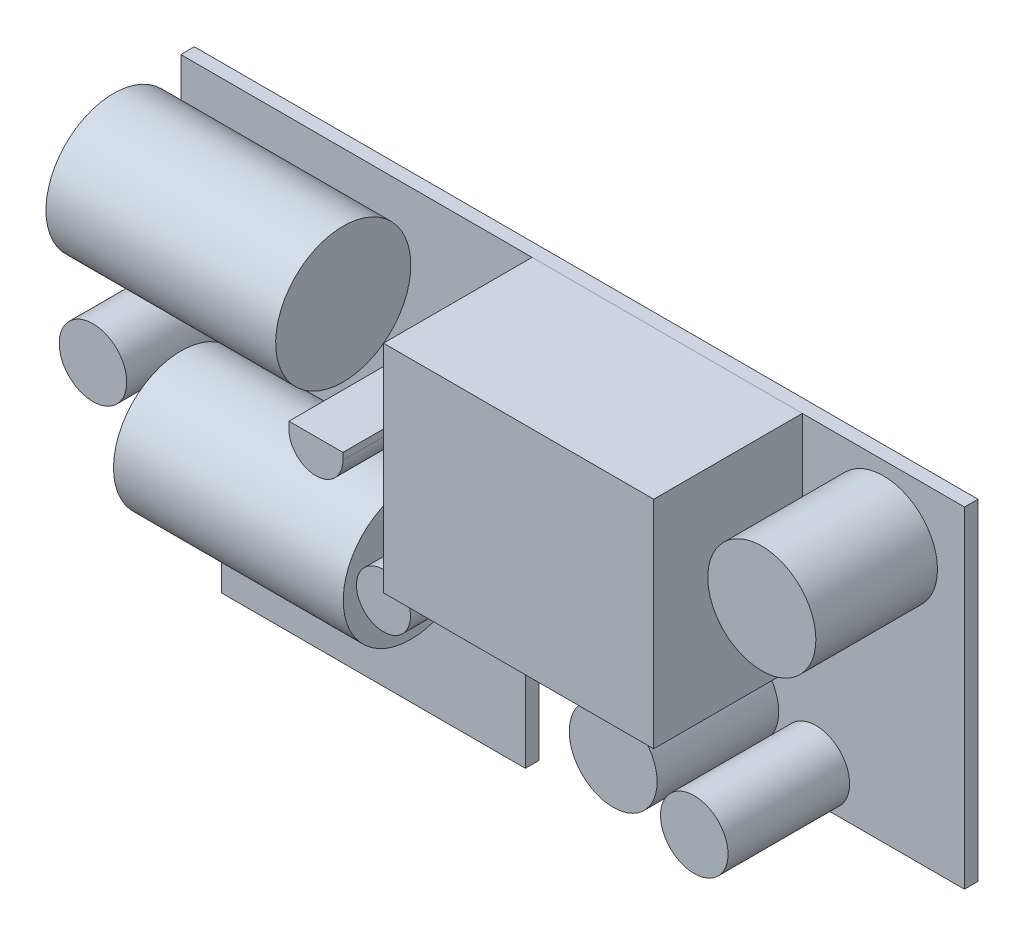
ISO-10303-21;
HEADER;
FILE_DESCRIPTION(('STEP AP214'),'2;1');
FILE_NAME('part.step','',(''),(''),'','','');
FILE_SCHEMA(('AUTOMOTIVE_DESIGN { 1 0 10303 214 1 1 1 1 }'));
ENDSEC;
DATA;
#1=APPLICATION_CONTEXT('core data for automotive mechanical design processes');
#2=APPLICATION_PROTOCOL_DEFINITION('international standard','automotive_design',2000,#1);
#3=PRODUCT_CONTEXT('',#1,'mechanical');
#4=PRODUCT('Part','Part','',(#3));
#5=PRODUCT_RELATED_PRODUCT_CATEGORY('part','',(#4));
#6=PRODUCT_DEFINITION_FORMATION('','',#4);
#7=PRODUCT_DEFINITION_CONTEXT('part definition',#1,'design');
#8=PRODUCT_DEFINITION('design','',#6,#7);
#9=PRODUCT_DEFINITION_SHAPE('','',#8);
#10=(LENGTH_UNIT() NAMED_UNIT(*) SI_UNIT(.MILLI.,.METRE.));
#11=(NAMED_UNIT(*) PLANE_ANGLE_UNIT() SI_UNIT($,.RADIAN.));
#12=(NAMED_UNIT(*) SI_UNIT($,.STERADIAN.) SOLID_ANGLE_UNIT());
#13=UNCERTAINTY_MEASURE_WITH_UNIT(LENGTH_MEASURE(1.E-05),#10,'distance_accuracy_value','');
#14=(GEOMETRIC_REPRESENTATION_CONTEXT(3) GLOBAL_UNCERTAINTY_ASSIGNED_CONTEXT((#13)) GLOBAL_UNIT_ASSIGNED_CONTEXT((#10,
#11,#12)) REPRESENTATION_CONTEXT('',''));
#15=CARTESIAN_POINT('',(0.,0.,0.));
#16=DIRECTION('',(0.,0.,1.));
#17=DIRECTION('',(1.,0.,0.));
#18=AXIS2_PLACEMENT_3D('',#15,#16,#17);
#19=CARTESIAN_POINT('',(-7.00000000000001,-2.5,5.97865494088978));
#20=DIRECTION('',(-1.,0.,0.));
#21=DIRECTION('',(0.,-1.,0.));
#22=AXIS2_PLACEMENT_3D('',#19,#20,#21);
#23=CYLINDRICAL_SURFACE('',#22,5.);
#24=CARTESIAN_POINT('',(-7.00000000000001,-2.5,5.97865494088978));
#25=DIRECTION('',(-1.,0.,0.));
#26=DIRECTION('',(0.,-1.,0.));
#27=AXIS2_PLACEMENT_3D('',#24,#25,#26);
#28=CIRCLE('',#27,5.);
#29=CARTESIAN_POINT('',(-7.00000000000001,-7.50000000000001,5.97865494088978));
#30=VERTEX_POINT('',#29);
#31=EDGE_CURVE('E11',#30,#30,#28,.T.);
#32=ORIENTED_EDGE('',*,*,#31,.T.);
#33=EDGE_LOOP('',(#32));
#34=FACE_BOUND('',#33,.T.);
#35=CARTESIAN_POINT('',(-24.,-2.5,5.97865494088978));
#36=DIRECTION('',(-1.,0.,0.));
#37=DIRECTION('',(0.,-1.,0.));
#38=AXIS2_PLACEMENT_3D('',#35,#36,#37);
#39=CIRCLE('',#38,5.);
#40=CARTESIAN_POINT('',(-24.,-7.50000000000001,5.97865494088978));
#41=VERTEX_POINT('',#40);
#42=EDGE_CURVE('E47',#41,#41,#39,.T.);
#43=ORIENTED_EDGE('',*,*,#42,.F.);
#44=EDGE_LOOP('',(#43));
#45=FACE_BOUND('',#44,.T.);
#46=ADVANCED_FACE('F44',(#34,#45),#23,.T.);
#47=CARTESIAN_POINT('',(-7.00000000000001,-2.5,5.97865494088978));
#48=DIRECTION('',(-1.,0.,0.));
#49=DIRECTION('',(0.,-1.,0.));
#50=AXIS2_PLACEMENT_3D('',#47,#48,#49);
#51=PLANE('',#50);
#52=ORIENTED_EDGE('',*,*,#31,.F.);
#53=EDGE_LOOP('',(#52));
#54=FACE_BOUND('',#53,.T.);
#55=ADVANCED_FACE('F59',(#54),#51,.F.);
#56=CARTESIAN_POINT('',(-24.,-2.5,5.97865494088978));
#57=DIRECTION('',(-1.,0.,0.));
#58=DIRECTION('',(0.,-1.,0.));
#59=AXIS2_PLACEMENT_3D('',#56,#57,#58);
#60=PLANE('',#59);
#61=ORIENTED_EDGE('',*,*,#42,.T.);
#62=EDGE_LOOP('',(#61));
#63=FACE_BOUND('',#62,.T.);
#64=ADVANCED_FACE('F56',(#63),#60,.T.);
#65=CLOSED_SHELL('',(#46,#55,#64));
#66=MANIFOLD_SOLID_BREP('B2',#65);
#67=CARTESIAN_POINT('',(-12.,11.5,5.97865494088978));
#68=DIRECTION('',(-1.,0.,0.));
#69=DIRECTION('',(0.,-1.,0.));
#70=AXIS2_PLACEMENT_3D('',#67,#68,#69);
#71=CYLINDRICAL_SURFACE('',#70,5.);
#72=CARTESIAN_POINT('',(-12.,11.5,5.97865494088978));
#73=DIRECTION('',(-1.,0.,0.));
#74=DIRECTION('',(0.,-1.,0.));
#75=AXIS2_PLACEMENT_3D('',#72,#73,#74);
#76=CIRCLE('',#75,5.);
#77=CARTESIAN_POINT('',(-12.,6.5,5.97865494088978));
#78=VERTEX_POINT('',#77);
#79=EDGE_CURVE('E43',#78,#78,#76,.T.);
#80=ORIENTED_EDGE('',*,*,#79,.T.);
#81=EDGE_LOOP('',(#80));
#82=FACE_BOUND('',#81,.T.);
#83=CARTESIAN_POINT('',(-29.,11.5,5.97865494088978));
#84=DIRECTION('',(-1.,0.,0.));
#85=DIRECTION('',(0.,-1.,0.));
#86=AXIS2_PLACEMENT_3D('',#83,#84,#85);
#87=CIRCLE('',#86,5.);
#88=CARTESIAN_POINT('',(-29.,6.5,5.97865494088978));
#89=VERTEX_POINT('',#88);
#90=EDGE_CURVE('E98',#89,#89,#87,.T.);
#91=ORIENTED_EDGE('',*,*,#90,.F.);
#92=EDGE_LOOP('',(#91));
#93=FACE_BOUND('',#92,.T.);
#94=ADVANCED_FACE('F95',(#82,#93),#71,.T.);
#95=CARTESIAN_POINT('',(-12.,11.5,5.97865494088978));
#96=DIRECTION('',(-1.,0.,0.));
#97=DIRECTION('',(0.,-1.,0.));
#98=AXIS2_PLACEMENT_3D('',#95,#96,#97);
#99=PLANE('',#98);
#100=ORIENTED_EDGE('',*,*,#79,.F.);
#101=EDGE_LOOP('',(#100));
#102=FACE_BOUND('',#101,.T.);
#103=ADVANCED_FACE('F110',(#102),#99,.F.);
#104=CARTESIAN_POINT('',(-29.,11.5,5.97865494088978));
#105=DIRECTION('',(-1.,0.,0.));
#106=DIRECTION('',(0.,-1.,0.));
#107=AXIS2_PLACEMENT_3D('',#104,#105,#106);
#108=PLANE('',#107);
#109=ORIENTED_EDGE('',*,*,#90,.T.);
#110=EDGE_LOOP('',(#109));
#111=FACE_BOUND('',#110,.T.);
#112=ADVANCED_FACE('F107',(#111),#108,.T.);
#113=CLOSED_SHELL('',(#94,#103,#112));
#114=MANIFOLD_SOLID_BREP('B6',#113);
#115=CARTESIAN_POINT('',(-12.,6.,10.));
#116=DIRECTION('',(1.,0.,0.));
#117=DIRECTION('',(0.,0.,-1.));
#118=AXIS2_PLACEMENT_3D('',#115,#116,#117);
#119=PLANE('',#118);
#120=DIRECTION('',(0.,-1.,0.));
#121=VECTOR('',#120,1.);
#122=CARTESIAN_POINT('',(-12.,6.,1.));
#123=LINE('',#122,#121);
#124=CARTESIAN_POINT('',(-12.,6.,1.));
#125=VERTEX_POINT('',#124);
#126=CARTESIAN_POINT('',(-12.,5.5,1.));
#127=VERTEX_POINT('',#126);
#128=EDGE_CURVE('E207',#125,#127,#123,.T.);
#129=ORIENTED_EDGE('',*,*,#128,.T.);
#130=DIRECTION('',(0.,0.,-1.));
#131=VECTOR('',#130,1.);
#132=CARTESIAN_POINT('',(-12.,5.5,10.));
#133=LINE('',#132,#131);
#134=CARTESIAN_POINT('',(-12.,5.5,10.));
#135=VERTEX_POINT('',#134);
#136=EDGE_CURVE('E93',#135,#127,#133,.T.);
#137=ORIENTED_EDGE('',*,*,#136,.F.);
#138=DIRECTION('',(0.,-1.,0.));
#139=VECTOR('',#138,1.);
#140=CARTESIAN_POINT('',(-12.,6.,10.));
#141=LINE('',#140,#139);
#142=CARTESIAN_POINT('',(-12.,6.,10.));
#143=VERTEX_POINT('',#142);
#144=EDGE_CURVE('E195',#143,#135,#141,.T.);
#145=ORIENTED_EDGE('',*,*,#144,.F.);
#146=DIRECTION('',(0.,0.,-1.));
#147=VECTOR('',#146,1.);
#148=CARTESIAN_POINT('',(-12.,6.,10.));
#149=LINE('',#148,#147);
#150=EDGE_CURVE('E203',#143,#125,#149,.T.);
#151=ORIENTED_EDGE('',*,*,#150,.T.);
#152=EDGE_LOOP('',(#129,#137,#145,#151));
#153=FACE_BOUND('',#152,.T.);
#154=ADVANCED_FACE('F144',(#153),#119,.F.);
#155=CARTESIAN_POINT('',(-10.,5.5,10.));
#156=DIRECTION('',(0.,0.,-1.));
#157=DIRECTION('',(-1.,0.,0.));
#158=AXIS2_PLACEMENT_3D('',#155,#156,#157);
#159=CYLINDRICAL_SURFACE('',#158,2.);
#160=CARTESIAN_POINT('',(-10.,5.5,1.));
#161=DIRECTION('',(0.,0.,1.));
#162=DIRECTION('',(1.,0.,0.));
#163=AXIS2_PLACEMENT_3D('',#160,#161,#162);
#164=CIRCLE('',#163,2.);
#165=CARTESIAN_POINT('',(-8.00000000000001,5.5,1.));
#166=VERTEX_POINT('',#165);
#167=EDGE_CURVE('E199',#127,#166,#164,.T.);
#168=ORIENTED_EDGE('',*,*,#167,.T.);
#169=DIRECTION('',(0.,0.,-1.));
#170=VECTOR('',#169,1.);
#171=CARTESIAN_POINT('',(-8.00000000000001,5.5,10.));
#172=LINE('',#171,#170);
#173=CARTESIAN_POINT('',(-8.00000000000001,5.5,10.));
#174=VERTEX_POINT('',#173);
#175=EDGE_CURVE('E152',#174,#166,#172,.T.);
#176=ORIENTED_EDGE('',*,*,#175,.F.);
#177=CARTESIAN_POINT('',(-10.,5.5,10.));
#178=DIRECTION('',(0.,0.,1.));
#179=DIRECTION('',(1.,0.,0.));
#180=AXIS2_PLACEMENT_3D('',#177,#178,#179);
#181=CIRCLE('',#180,2.);
#182=EDGE_CURVE('E190',#135,#174,#181,.T.);
#183=ORIENTED_EDGE('',*,*,#182,.F.);
#184=ORIENTED_EDGE('',*,*,#136,.T.);
#185=EDGE_LOOP('',(#168,#176,#183,#184));
#186=FACE_BOUND('',#185,.T.);
#187=ADVANCED_FACE('F198',(#186),#159,.T.);
#188=CARTESIAN_POINT('',(-8.00000000000001,6.,10.));
#189=DIRECTION('',(-1.,0.,0.));
#190=DIRECTION('',(0.,0.,1.));
#191=AXIS2_PLACEMENT_3D('',#188,#189,#190);
#192=PLANE('',#191);
#193=DIRECTION('',(0.,1.,0.));
#194=VECTOR('',#193,1.);
#195=CARTESIAN_POINT('',(-8.00000000000001,6.,1.));
#196=LINE('',#195,#194);
#197=CARTESIAN_POINT('',(-8.00000000000001,6.,1.));
#198=VERTEX_POINT('',#197);
#199=EDGE_CURVE('E177',#166,#198,#196,.T.);
#200=ORIENTED_EDGE('',*,*,#199,.T.);
#201=DIRECTION('',(0.,0.,-1.));
#202=VECTOR('',#201,1.);
#203=CARTESIAN_POINT('',(-8.00000000000001,6.,10.));
#204=LINE('',#203,#202);
#205=CARTESIAN_POINT('',(-8.00000000000001,6.,10.));
#206=VERTEX_POINT('',#205);
#207=EDGE_CURVE('E200',#206,#198,#204,.T.);
#208=ORIENTED_EDGE('',*,*,#207,.F.);
#209=DIRECTION('',(0.,1.,0.));
#210=VECTOR('',#209,1.);
#211=CARTESIAN_POINT('',(-8.00000000000001,6.,10.));
#212=LINE('',#211,#210);
#213=EDGE_CURVE('E193',#174,#206,#212,.T.);
#214=ORIENTED_EDGE('',*,*,#213,.F.);
#215=ORIENTED_EDGE('',*,*,#175,.T.);
#216=EDGE_LOOP('',(#200,#208,#214,#215));
#217=FACE_BOUND('',#216,.T.);
#218=ADVANCED_FACE('F201',(#217),#192,.F.);
#219=CARTESIAN_POINT('',(-12.,6.,10.));
#220=DIRECTION('',(0.,-1.,0.));
#221=DIRECTION('',(0.,0.,-1.));
#222=AXIS2_PLACEMENT_3D('',#219,#220,#221);
#223=PLANE('',#222);
#224=DIRECTION('',(-1.,0.,0.));
#225=VECTOR('',#224,1.);
#226=CARTESIAN_POINT('',(-12.,6.,1.));
#227=LINE('',#226,#225);
#228=EDGE_CURVE('E183',#198,#125,#227,.T.);
#229=ORIENTED_EDGE('',*,*,#228,.T.);
#230=ORIENTED_EDGE('',*,*,#150,.F.);
#231=DIRECTION('',(-1.,0.,0.));
#232=VECTOR('',#231,1.);
#233=CARTESIAN_POINT('',(-12.,6.,10.));
#234=LINE('',#233,#232);
#235=EDGE_CURVE('E160',#206,#143,#234,.T.);
#236=ORIENTED_EDGE('',*,*,#235,.F.);
#237=ORIENTED_EDGE('',*,*,#207,.T.);
#238=EDGE_LOOP('',(#229,#230,#236,#237));
#239=FACE_BOUND('',#238,.T.);
#240=ADVANCED_FACE('F214',(#239),#223,.F.);
#241=CARTESIAN_POINT('',(-10.,5.5,10.));
#242=DIRECTION('',(0.,0.,1.));
#243=DIRECTION('',(1.,0.,0.));
#244=AXIS2_PLACEMENT_3D('',#241,#242,#243);
#245=PLANE('',#244);
#246=ORIENTED_EDGE('',*,*,#144,.T.);
#247=ORIENTED_EDGE('',*,*,#182,.T.);
#248=ORIENTED_EDGE('',*,*,#213,.T.);
#249=ORIENTED_EDGE('',*,*,#235,.T.);
#250=EDGE_LOOP('',(#246,#247,#248,#249));
#251=FACE_BOUND('',#250,.T.);
#252=ADVANCED_FACE('F191',(#251),#245,.T.);
#253=CARTESIAN_POINT('',(-10.,5.5,1.));
#254=DIRECTION('',(0.,0.,1.));
#255=DIRECTION('',(1.,0.,0.));
#256=AXIS2_PLACEMENT_3D('',#253,#254,#255);
#257=PLANE('',#256);
#258=ORIENTED_EDGE('',*,*,#128,.F.);
#259=ORIENTED_EDGE('',*,*,#228,.F.);
#260=ORIENTED_EDGE('',*,*,#199,.F.);
#261=ORIENTED_EDGE('',*,*,#167,.F.);
#262=EDGE_LOOP('',(#258,#259,#260,#261));
#263=FACE_BOUND('',#262,.T.);
#264=ADVANCED_FACE('F217',(#263),#257,.F.);
#265=CLOSED_SHELL('',(#154,#187,#218,#240,#252,#264));
#266=MANIFOLD_SOLID_BREP('B38',#265);
#267=CARTESIAN_POINT('',(-5.00000000000001,-2.00000000000001,10.));
#268=DIRECTION('',(0.,0.,-1.));
#269=DIRECTION('',(-1.,0.,0.));
#270=AXIS2_PLACEMENT_3D('',#267,#268,#269);
#271=CYLINDRICAL_SURFACE('',#270,2.);
#272=CARTESIAN_POINT('',(-5.00000000000001,-2.00000000000001,10.));
#273=DIRECTION('',(0.,0.,1.));
#274=DIRECTION('',(1.,0.,0.));
#275=AXIS2_PLACEMENT_3D('',#272,#273,#274);
#276=CIRCLE('',#275,2.);
#277=CARTESIAN_POINT('',(-3.00000000000001,-2.00000000000001,10.));
#278=VERTEX_POINT('',#277);
#279=EDGE_CURVE('E143',#278,#278,#276,.T.);
#280=ORIENTED_EDGE('',*,*,#279,.F.);
#281=EDGE_LOOP('',(#280));
#282=FACE_BOUND('',#281,.T.);
#283=CARTESIAN_POINT('',(-5.00000000000001,-2.00000000000001,1.));
#284=DIRECTION('',(0.,0.,1.));
#285=DIRECTION('',(1.,0.,0.));
#286=AXIS2_PLACEMENT_3D('',#283,#284,#285);
#287=CIRCLE('',#286,2.);
#288=CARTESIAN_POINT('',(-3.00000000000001,-2.00000000000001,1.));
#289=VERTEX_POINT('',#288);
#290=EDGE_CURVE('E279',#289,#289,#287,.T.);
#291=ORIENTED_EDGE('',*,*,#290,.T.);
#292=EDGE_LOOP('',(#291));
#293=FACE_BOUND('',#292,.T.);
#294=ADVANCED_FACE('F276',(#282,#293),#271,.T.);
#295=CARTESIAN_POINT('',(-5.00000000000001,-2.00000000000001,10.));
#296=DIRECTION('',(0.,0.,1.));
#297=DIRECTION('',(1.,0.,0.));
#298=AXIS2_PLACEMENT_3D('',#295,#296,#297);
#299=PLANE('',#298);
#300=ORIENTED_EDGE('',*,*,#279,.T.);
#301=EDGE_LOOP('',(#300));
#302=FACE_BOUND('',#301,.T.);
#303=ADVANCED_FACE('F291',(#302),#299,.T.);
#304=CARTESIAN_POINT('',(-5.00000000000001,-2.00000000000001,1.));
#305=DIRECTION('',(0.,0.,1.));
#306=DIRECTION('',(1.,0.,0.));
#307=AXIS2_PLACEMENT_3D('',#304,#305,#306);
#308=PLANE('',#307);
#309=ORIENTED_EDGE('',*,*,#290,.F.);
#310=EDGE_LOOP('',(#309));
#311=FACE_BOUND('',#310,.T.);
#312=ADVANCED_FACE('F289',(#311),#308,.F.);
#313=CLOSED_SHELL('',(#294,#303,#312));
#314=MANIFOLD_SOLID_BREP('B87',#313);
#315=CARTESIAN_POINT('',(-26.5,2.5,10.));
#316=DIRECTION('',(0.,0.,-1.));
#317=DIRECTION('',(-1.,0.,0.));
#318=AXIS2_PLACEMENT_3D('',#315,#316,#317);
#319=CYLINDRICAL_SURFACE('',#318,2.5);
#320=CARTESIAN_POINT('',(-26.5,2.5,10.));
#321=DIRECTION('',(0.,0.,1.));
#322=DIRECTION('',(1.,0.,0.));
#323=AXIS2_PLACEMENT_3D('',#320,#321,#322);
#324=CIRCLE('',#323,2.5);
#325=CARTESIAN_POINT('',(-24.,2.5,10.));
#326=VERTEX_POINT('',#325);
#327=EDGE_CURVE('E275',#326,#326,#324,.T.);
#328=ORIENTED_EDGE('',*,*,#327,.F.);
#329=EDGE_LOOP('',(#328));
#330=FACE_BOUND('',#329,.T.);
#331=CARTESIAN_POINT('',(-26.5,2.5,1.));
#332=DIRECTION('',(0.,0.,1.));
#333=DIRECTION('',(1.,0.,0.));
#334=AXIS2_PLACEMENT_3D('',#331,#332,#333);
#335=CIRCLE('',#334,2.5);
#336=CARTESIAN_POINT('',(-24.,2.5,1.));
#337=VERTEX_POINT('',#336);
#338=EDGE_CURVE('E328',#337,#337,#335,.T.);
#339=ORIENTED_EDGE('',*,*,#338,.T.);
#340=EDGE_LOOP('',(#339));
#341=FACE_BOUND('',#340,.T.);
#342=ADVANCED_FACE('F325',(#330,#341),#319,.T.);
#343=CARTESIAN_POINT('',(-26.5,2.5,10.));
#344=DIRECTION('',(0.,0.,1.));
#345=DIRECTION('',(1.,0.,0.));
#346=AXIS2_PLACEMENT_3D('',#343,#344,#345);
#347=PLANE('',#346);
#348=ORIENTED_EDGE('',*,*,#327,.T.);
#349=EDGE_LOOP('',(#348));
#350=FACE_BOUND('',#349,.T.);
#351=ADVANCED_FACE('F340',(#350),#347,.T.);
#352=CARTESIAN_POINT('',(-26.5,2.5,1.));
#353=DIRECTION('',(0.,0.,1.));
#354=DIRECTION('',(1.,0.,0.));
#355=AXIS2_PLACEMENT_3D('',#352,#353,#354);
#356=PLANE('',#355);
#357=ORIENTED_EDGE('',*,*,#338,.F.);
#358=EDGE_LOOP('',(#357));
#359=FACE_BOUND('',#358,.T.);
#360=ADVANCED_FACE('F338',(#359),#356,.F.);
#361=CLOSED_SHELL('',(#342,#351,#360));
#362=MANIFOLD_SOLID_BREP('B138',#361);
#363=CARTESIAN_POINT('',(23.,11.5,10.));
#364=DIRECTION('',(0.,0.,-1.));
#365=DIRECTION('',(-1.,0.,0.));
#366=AXIS2_PLACEMENT_3D('',#363,#364,#365);
#367=CYLINDRICAL_SURFACE('',#366,4.);
#368=CARTESIAN_POINT('',(23.,11.5,10.));
#369=DIRECTION('',(0.,0.,1.));
#370=DIRECTION('',(1.,0.,0.));
#371=AXIS2_PLACEMENT_3D('',#368,#369,#370);
#372=CIRCLE('',#371,4.);
#373=CARTESIAN_POINT('',(27.,11.5,10.));
#374=VERTEX_POINT('',#373);
#375=EDGE_CURVE('E324',#374,#374,#372,.T.);
#376=ORIENTED_EDGE('',*,*,#375,.F.);
#377=EDGE_LOOP('',(#376));
#378=FACE_BOUND('',#377,.T.);
#379=CARTESIAN_POINT('',(23.,11.5,1.));
#380=DIRECTION('',(0.,0.,1.));
#381=DIRECTION('',(1.,0.,0.));
#382=AXIS2_PLACEMENT_3D('',#379,#380,#381);
#383=CIRCLE('',#382,4.);
#384=CARTESIAN_POINT('',(27.,11.5,1.));
#385=VERTEX_POINT('',#384);
#386=EDGE_CURVE('E377',#385,#385,#383,.T.);
#387=ORIENTED_EDGE('',*,*,#386,.T.);
#388=EDGE_LOOP('',(#387));
#389=FACE_BOUND('',#388,.T.);
#390=ADVANCED_FACE('F374',(#378,#389),#367,.T.);
#391=CARTESIAN_POINT('',(23.,11.5,10.));
#392=DIRECTION('',(0.,0.,1.));
#393=DIRECTION('',(1.,0.,0.));
#394=AXIS2_PLACEMENT_3D('',#391,#392,#393);
#395=PLANE('',#394);
#396=ORIENTED_EDGE('',*,*,#375,.T.);
#397=EDGE_LOOP('',(#396));
#398=FACE_BOUND('',#397,.T.);
#399=ADVANCED_FACE('F389',(#398),#395,.T.);
#400=CARTESIAN_POINT('',(23.,11.5,1.));
#401=DIRECTION('',(0.,0.,1.));
#402=DIRECTION('',(1.,0.,0.));
#403=AXIS2_PLACEMENT_3D('',#400,#401,#402);
#404=PLANE('',#403);
#405=ORIENTED_EDGE('',*,*,#386,.F.);
#406=EDGE_LOOP('',(#405));
#407=FACE_BOUND('',#406,.T.);
#408=ADVANCED_FACE('F387',(#407),#404,.F.);
#409=CLOSED_SHELL('',(#390,#399,#408));
#410=MANIFOLD_SOLID_BREP('B270',#409);
#411=CARTESIAN_POINT('',(18.,-5.5,10.));
#412=DIRECTION('',(0.,0.,-1.));
#413=DIRECTION('',(-1.,0.,0.));
#414=AXIS2_PLACEMENT_3D('',#411,#412,#413);
#415=CYLINDRICAL_SURFACE('',#414,2.5);
#416=CARTESIAN_POINT('',(18.,-5.5,10.));
#417=DIRECTION('',(0.,0.,1.));
#418=DIRECTION('',(1.,0.,0.));
#419=AXIS2_PLACEMENT_3D('',#416,#417,#418);
#420=CIRCLE('',#419,2.5);
#421=CARTESIAN_POINT('',(20.5,-5.5,10.));
#422=VERTEX_POINT('',#421);
#423=EDGE_CURVE('E373',#422,#422,#420,.T.);
#424=ORIENTED_EDGE('',*,*,#423,.F.);
#425=EDGE_LOOP('',(#424));
#426=FACE_BOUND('',#425,.T.);
#427=CARTESIAN_POINT('',(18.,-5.5,1.));
#428=DIRECTION('',(0.,0.,1.));
#429=DIRECTION('',(1.,0.,0.));
#430=AXIS2_PLACEMENT_3D('',#427,#428,#429);
#431=CIRCLE('',#430,2.5);
#432=CARTESIAN_POINT('',(20.5,-5.5,1.));
#433=VERTEX_POINT('',#432);
#434=EDGE_CURVE('E426',#433,#433,#431,.T.);
#435=ORIENTED_EDGE('',*,*,#434,.T.);
#436=EDGE_LOOP('',(#435));
#437=FACE_BOUND('',#436,.T.);
#438=ADVANCED_FACE('F423',(#426,#437),#415,.T.);
#439=CARTESIAN_POINT('',(18.,-5.5,10.));
#440=DIRECTION('',(0.,0.,1.));
#441=DIRECTION('',(1.,0.,0.));
#442=AXIS2_PLACEMENT_3D('',#439,#440,#441);
#443=PLANE('',#442);
#444=ORIENTED_EDGE('',*,*,#423,.T.);
#445=EDGE_LOOP('',(#444));
#446=FACE_BOUND('',#445,.T.);
#447=ADVANCED_FACE('F438',(#446),#443,.T.);
#448=CARTESIAN_POINT('',(18.,-5.5,1.));
#449=DIRECTION('',(0.,0.,1.));
#450=DIRECTION('',(1.,0.,0.));
#451=AXIS2_PLACEMENT_3D('',#448,#449,#450);
#452=PLANE('',#451);
#453=ORIENTED_EDGE('',*,*,#434,.F.);
#454=EDGE_LOOP('',(#453));
#455=FACE_BOUND('',#454,.T.);
#456=ADVANCED_FACE('F436',(#455),#452,.F.);
#457=CLOSED_SHELL('',(#438,#447,#456));
#458=MANIFOLD_SOLID_BREP('B319',#457);
#459=CARTESIAN_POINT('',(12.,-3.5,10.));
#460=DIRECTION('',(0.,0.,-1.));
#461=DIRECTION('',(-1.,0.,0.));
#462=AXIS2_PLACEMENT_3D('',#459,#460,#461);
#463=CYLINDRICAL_SURFACE('',#462,3.25);
#464=CARTESIAN_POINT('',(12.,-3.5,10.));
#465=DIRECTION('',(0.,0.,1.));
#466=DIRECTION('',(1.,0.,0.));
#467=AXIS2_PLACEMENT_3D('',#464,#465,#466);
#468=CIRCLE('',#467,3.25);
#469=CARTESIAN_POINT('',(15.25,-3.5,10.));
#470=VERTEX_POINT('',#469);
#471=EDGE_CURVE('E422',#470,#470,#468,.T.);
#472=ORIENTED_EDGE('',*,*,#471,.F.);
#473=EDGE_LOOP('',(#472));
#474=FACE_BOUND('',#473,.T.);
#475=CARTESIAN_POINT('',(12.,-3.5,1.));
#476=DIRECTION('',(0.,0.,1.));
#477=DIRECTION('',(1.,0.,0.));
#478=AXIS2_PLACEMENT_3D('',#475,#476,#477);
#479=CIRCLE('',#478,3.25);
#480=CARTESIAN_POINT('',(15.25,-3.5,1.));
#481=VERTEX_POINT('',#480);
#482=EDGE_CURVE('E477',#481,#481,#479,.T.);
#483=ORIENTED_EDGE('',*,*,#482,.T.);
#484=EDGE_LOOP('',(#483));
#485=FACE_BOUND('',#484,.T.);
#486=ADVANCED_FACE('F474',(#474,#485),#463,.T.);
#487=CARTESIAN_POINT('',(12.,-3.5,10.));
#488=DIRECTION('',(0.,0.,1.));
#489=DIRECTION('',(1.,0.,0.));
#490=AXIS2_PLACEMENT_3D('',#487,#488,#489);
#491=PLANE('',#490);
#492=ORIENTED_EDGE('',*,*,#471,.T.);
#493=EDGE_LOOP('',(#492));
#494=FACE_BOUND('',#493,.T.);
#495=ADVANCED_FACE('F489',(#494),#491,.T.);
#496=CARTESIAN_POINT('',(12.,-3.5,1.));
#497=DIRECTION('',(0.,0.,1.));
#498=DIRECTION('',(1.,0.,0.));
#499=AXIS2_PLACEMENT_3D('',#496,#497,#498);
#500=PLANE('',#499);
#501=ORIENTED_EDGE('',*,*,#482,.F.);
#502=EDGE_LOOP('',(#501));
#503=FACE_BOUND('',#502,.T.);
#504=ADVANCED_FACE('F487',(#503),#500,.F.);
#505=CLOSED_SHELL('',(#486,#495,#504));
#506=MANIFOLD_SOLID_BREP('B368',#505);
#507=CARTESIAN_POINT('',(-3.00000000000001,16.5,12.));
#508=DIRECTION('',(1.,0.,0.));
#509=DIRECTION('',(0.,1.,0.));
#510=AXIS2_PLACEMENT_3D('',#507,#508,#509);
#511=PLANE('',#510);
#512=DIRECTION('',(0.,-1.,0.));
#513=VECTOR('',#512,1.);
#514=CARTESIAN_POINT('',(-3.00000000000001,16.5,1.));
#515=LINE('',#514,#513);
#516=CARTESIAN_POINT('',(-3.00000000000001,16.5,1.));
#517=VERTEX_POINT('',#516);
#518=CARTESIAN_POINT('',(-3.00000000000001,0.499999999999997,1.));
#519=VERTEX_POINT('',#518);
#520=EDGE_CURVE('E587',#517,#519,#515,.T.);
#521=ORIENTED_EDGE('',*,*,#520,.T.);
#522=DIRECTION('',(0.,0.,-1.));
#523=VECTOR('',#522,1.);
#524=CARTESIAN_POINT('',(-3.00000000000001,0.499999999999997,12.));
#525=LINE('',#524,#523);
#526=CARTESIAN_POINT('',(-3.00000000000001,0.499999999999997,12.));
#527=VERTEX_POINT('',#526);
#528=EDGE_CURVE('E472',#527,#519,#525,.T.);
#529=ORIENTED_EDGE('',*,*,#528,.F.);
#530=DIRECTION('',(0.,-1.,0.));
#531=VECTOR('',#530,1.);
#532=CARTESIAN_POINT('',(-3.00000000000001,16.5,12.));
#533=LINE('',#532,#531);
#534=CARTESIAN_POINT('',(-3.00000000000001,16.5,12.));
#535=VERTEX_POINT('',#534);
#536=EDGE_CURVE('E575',#535,#527,#533,.T.);
#537=ORIENTED_EDGE('',*,*,#536,.F.);
#538=DIRECTION('',(0.,0.,-1.));
#539=VECTOR('',#538,1.);
#540=CARTESIAN_POINT('',(-3.00000000000001,16.5,12.));
#541=LINE('',#540,#539);
#542=EDGE_CURVE('E583',#535,#517,#541,.T.);
#543=ORIENTED_EDGE('',*,*,#542,.T.);
#544=EDGE_LOOP('',(#521,#529,#537,#543));
#545=FACE_BOUND('',#544,.T.);
#546=ADVANCED_FACE('F524',(#545),#511,.F.);
#547=CARTESIAN_POINT('',(-3.00000000000001,0.499999999999997,12.));
#548=DIRECTION('',(0.,1.,0.));
#549=DIRECTION('',(0.,0.,1.));
#550=AXIS2_PLACEMENT_3D('',#547,#548,#549);
#551=PLANE('',#550);
#552=DIRECTION('',(1.,0.,0.));
#553=VECTOR('',#552,1.);
#554=CARTESIAN_POINT('',(-3.00000000000001,0.499999999999997,1.));
#555=LINE('',#554,#553);
#556=CARTESIAN_POINT('',(17.,0.499999999999997,1.));
#557=VERTEX_POINT('',#556);
#558=EDGE_CURVE('E579',#519,#557,#555,.T.);
#559=ORIENTED_EDGE('',*,*,#558,.T.);
#560=DIRECTION('',(0.,0.,-1.));
#561=VECTOR('',#560,1.);
#562=CARTESIAN_POINT('',(17.,0.499999999999997,12.));
#563=LINE('',#562,#561);
#564=CARTESIAN_POINT('',(17.,0.499999999999997,12.));
#565=VERTEX_POINT('',#564);
#566=EDGE_CURVE('E532',#565,#557,#563,.T.);
#567=ORIENTED_EDGE('',*,*,#566,.F.);
#568=DIRECTION('',(1.,0.,0.));
#569=VECTOR('',#568,1.);
#570=CARTESIAN_POINT('',(-3.00000000000001,0.499999999999997,12.));
#571=LINE('',#570,#569);
#572=EDGE_CURVE('E570',#527,#565,#571,.T.);
#573=ORIENTED_EDGE('',*,*,#572,.F.);
#574=ORIENTED_EDGE('',*,*,#528,.T.);
#575=EDGE_LOOP('',(#559,#567,#573,#574));
#576=FACE_BOUND('',#575,.T.);
#577=ADVANCED_FACE('F578',(#576),#551,.F.);
#578=CARTESIAN_POINT('',(17.,16.5,12.));
#579=DIRECTION('',(-1.,0.,0.));
#580=DIRECTION('',(0.,-1.,0.));
#581=AXIS2_PLACEMENT_3D('',#578,#579,#580);
#582=PLANE('',#581);
#583=DIRECTION('',(0.,1.,0.));
#584=VECTOR('',#583,1.);
#585=CARTESIAN_POINT('',(17.,16.5,1.));
#586=LINE('',#585,#584);
#587=CARTESIAN_POINT('',(17.,16.5,1.));
#588=VERTEX_POINT('',#587);
#589=EDGE_CURVE('E557',#557,#588,#586,.T.);
#590=ORIENTED_EDGE('',*,*,#589,.T.);
#591=DIRECTION('',(0.,0.,-1.));
#592=VECTOR('',#591,1.);
#593=CARTESIAN_POINT('',(17.,16.5,12.));
#594=LINE('',#593,#592);
#595=CARTESIAN_POINT('',(17.,16.5,12.));
#596=VERTEX_POINT('',#595);
#597=EDGE_CURVE('E580',#596,#588,#594,.T.);
#598=ORIENTED_EDGE('',*,*,#597,.F.);
#599=DIRECTION('',(0.,1.,0.));
#600=VECTOR('',#599,1.);
#601=CARTESIAN_POINT('',(17.,16.5,12.));
#602=LINE('',#601,#600);
#603=EDGE_CURVE('E573',#565,#596,#602,.T.);
#604=ORIENTED_EDGE('',*,*,#603,.F.);
#605=ORIENTED_EDGE('',*,*,#566,.T.);
#606=EDGE_LOOP('',(#590,#598,#604,#605));
#607=FACE_BOUND('',#606,.T.);
#608=ADVANCED_FACE('F581',(#607),#582,.F.);
#609=CARTESIAN_POINT('',(-3.00000000000001,16.5,12.));
#610=DIRECTION('',(0.,-1.,0.));
#611=DIRECTION('',(0.,0.,-1.));
#612=AXIS2_PLACEMENT_3D('',#609,#610,#611);
#613=PLANE('',#612);
#614=DIRECTION('',(-1.,0.,0.));
#615=VECTOR('',#614,1.);
#616=CARTESIAN_POINT('',(-3.00000000000001,16.5,1.));
#617=LINE('',#616,#615);
#618=EDGE_CURVE('E563',#588,#517,#617,.T.);
#619=ORIENTED_EDGE('',*,*,#618,.T.);
#620=ORIENTED_EDGE('',*,*,#542,.F.);
#621=DIRECTION('',(-1.,0.,0.));
#622=VECTOR('',#621,1.);
#623=CARTESIAN_POINT('',(-3.00000000000001,16.5,12.));
#624=LINE('',#623,#622);
#625=EDGE_CURVE('E540',#596,#535,#624,.T.);
#626=ORIENTED_EDGE('',*,*,#625,.F.);
#627=ORIENTED_EDGE('',*,*,#597,.T.);
#628=EDGE_LOOP('',(#619,#620,#626,#627));
#629=FACE_BOUND('',#628,.T.);
#630=ADVANCED_FACE('F594',(#629),#613,.F.);
#631=CARTESIAN_POINT('',(0.,0.,12.));
#632=DIRECTION('',(0.,0.,1.));
#633=DIRECTION('',(1.,0.,0.));
#634=AXIS2_PLACEMENT_3D('',#631,#632,#633);
#635=PLANE('',#634);
#636=ORIENTED_EDGE('',*,*,#536,.T.);
#637=ORIENTED_EDGE('',*,*,#572,.T.);
#638=ORIENTED_EDGE('',*,*,#603,.T.);
#639=ORIENTED_EDGE('',*,*,#625,.T.);
#640=EDGE_LOOP('',(#636,#637,#638,#639));
#641=FACE_BOUND('',#640,.T.);
#642=ADVANCED_FACE('F571',(#641),#635,.T.);
#643=CARTESIAN_POINT('',(0.,0.,1.));
#644=DIRECTION('',(0.,0.,1.));
#645=DIRECTION('',(1.,0.,0.));
#646=AXIS2_PLACEMENT_3D('',#643,#644,#645);
#647=PLANE('',#646);
#648=ORIENTED_EDGE('',*,*,#520,.F.);
#649=ORIENTED_EDGE('',*,*,#618,.F.);
#650=ORIENTED_EDGE('',*,*,#589,.F.);
#651=ORIENTED_EDGE('',*,*,#558,.F.);
#652=EDGE_LOOP('',(#648,#649,#650,#651));
#653=FACE_BOUND('',#652,.T.);
#654=ADVANCED_FACE('F597',(#653),#647,.F.);
#655=CLOSED_SHELL('',(#546,#577,#608,#630,#642,#654));
#656=MANIFOLD_SOLID_BREP('B417',#655);
#657=CARTESIAN_POINT('',(29.,16.5,1.));
#658=DIRECTION('',(-1.,0.,0.));
#659=DIRECTION('',(0.,-1.,0.));
#660=AXIS2_PLACEMENT_3D('',#657,#658,#659);
#661=PLANE('',#660);
#662=DIRECTION('',(0.,1.,0.));
#663=VECTOR('',#662,1.);
#664=CARTESIAN_POINT('',(29.,16.5,1.));
#665=LINE('',#664,#663);
#666=CARTESIAN_POINT('',(29.,-8.,1.));
#667=VERTEX_POINT('',#666);
#668=CARTESIAN_POINT('',(29.,16.5,1.));
#669=VERTEX_POINT('',#668);
#670=EDGE_CURVE('E733',#667,#669,#665,.T.);
#671=ORIENTED_EDGE('',*,*,#670,.F.);
#672=DIRECTION('',(0.,0.,1.));
#673=VECTOR('',#672,1.);
#674=CARTESIAN_POINT('',(29.,-8.,0.));
#675=LINE('',#674,#673);
#676=CARTESIAN_POINT('',(29.,-8.,0.));
#677=VERTEX_POINT('',#676);
#678=EDGE_CURVE('E773',#677,#667,#675,.T.);
#679=ORIENTED_EDGE('',*,*,#678,.F.);
#680=DIRECTION('',(0.,1.,0.));
#681=VECTOR('',#680,1.);
#682=CARTESIAN_POINT('',(29.,16.5,0.));
#683=LINE('',#682,#681);
#684=CARTESIAN_POINT('',(29.,16.5,0.));
#685=VERTEX_POINT('',#684);
#686=EDGE_CURVE('E755',#677,#685,#683,.T.);
#687=ORIENTED_EDGE('',*,*,#686,.T.);
#688=DIRECTION('',(0.,0.,-1.));
#689=VECTOR('',#688,1.);
#690=CARTESIAN_POINT('',(29.,16.5,1.));
#691=LINE('',#690,#689);
#692=EDGE_CURVE('E522',#669,#685,#691,.T.);
#693=ORIENTED_EDGE('',*,*,#692,.F.);
#694=EDGE_LOOP('',(#671,#679,#687,#693));
#695=FACE_BOUND('',#694,.T.);
#696=ADVANCED_FACE('F648',(#695),#661,.F.);
#697=CARTESIAN_POINT('',(-29.,16.5,1.));
#698=DIRECTION('',(0.,-1.,0.));
#699=DIRECTION('',(0.,0.,-1.));
#700=AXIS2_PLACEMENT_3D('',#697,#698,#699);
#701=PLANE('',#700);
#702=DIRECTION('',(-1.,0.,0.));
#703=VECTOR('',#702,1.);
#704=CARTESIAN_POINT('',(-29.,16.5,0.));
#705=LINE('',#704,#703);
#706=CARTESIAN_POINT('',(-29.,16.5,0.));
#707=VERTEX_POINT('',#706);
#708=EDGE_CURVE('E739',#685,#707,#705,.T.);
#709=ORIENTED_EDGE('',*,*,#708,.T.);
#710=DIRECTION('',(0.,0.,-1.));
#711=VECTOR('',#710,1.);
#712=CARTESIAN_POINT('',(-29.,16.5,1.));
#713=LINE('',#712,#711);
#714=CARTESIAN_POINT('',(-29.,16.5,1.));
#715=VERTEX_POINT('',#714);
#716=EDGE_CURVE('E655',#715,#707,#713,.T.);
#717=ORIENTED_EDGE('',*,*,#716,.F.);
#718=DIRECTION('',(-1.,0.,0.));
#719=VECTOR('',#718,1.);
#720=CARTESIAN_POINT('',(-29.,16.5,1.));
#721=LINE('',#720,#719);
#722=EDGE_CURVE('E736',#669,#715,#721,.T.);
#723=ORIENTED_EDGE('',*,*,#722,.F.);
#724=ORIENTED_EDGE('',*,*,#692,.T.);
#725=EDGE_LOOP('',(#709,#717,#723,#724));
#726=FACE_BOUND('',#725,.T.);
#727=ADVANCED_FACE('F759',(#726),#701,.F.);
#728=CARTESIAN_POINT('',(-29.,16.5,1.));
#729=DIRECTION('',(1.,0.,0.));
#730=DIRECTION('',(0.,1.,0.));
#731=AXIS2_PLACEMENT_3D('',#728,#729,#730);
#732=PLANE('',#731);
#733=DIRECTION('',(0.,-1.,0.));
#734=VECTOR('',#733,1.);
#735=CARTESIAN_POINT('',(-29.,16.5,0.));
#736=LINE('',#735,#734);
#737=CARTESIAN_POINT('',(-29.,-8.,0.));
#738=VERTEX_POINT('',#737);
#739=EDGE_CURVE('E734',#707,#738,#736,.T.);
#740=ORIENTED_EDGE('',*,*,#739,.T.);
#741=DIRECTION('',(0.,0.,1.));
#742=VECTOR('',#741,1.);
#743=CARTESIAN_POINT('',(-29.,-8.,0.));
#744=LINE('',#743,#742);
#745=CARTESIAN_POINT('',(-29.,-8.,1.));
#746=VERTEX_POINT('',#745);
#747=EDGE_CURVE('E756',#738,#746,#744,.T.);
#748=ORIENTED_EDGE('',*,*,#747,.T.);
#749=DIRECTION('',(0.,-1.,0.));
#750=VECTOR('',#749,1.);
#751=CARTESIAN_POINT('',(-29.,16.5,1.));
#752=LINE('',#751,#750);
#753=EDGE_CURVE('E747',#715,#746,#752,.T.);
#754=ORIENTED_EDGE('',*,*,#753,.F.);
#755=ORIENTED_EDGE('',*,*,#716,.T.);
#756=EDGE_LOOP('',(#740,#748,#754,#755));
#757=FACE_BOUND('',#756,.T.);
#758=ADVANCED_FACE('F764',(#757),#732,.F.);
#759=CARTESIAN_POINT('',(-29.,-16.5,1.));
#760=DIRECTION('',(0.,1.,0.));
#761=DIRECTION('',(0.,0.,1.));
#762=AXIS2_PLACEMENT_3D('',#759,#760,#761);
#763=PLANE('',#762);
#764=DIRECTION('',(1.,0.,0.));
#765=VECTOR('',#764,1.);
#766=CARTESIAN_POINT('',(-29.,-16.5,1.));
#767=LINE('',#766,#765);
#768=CARTESIAN_POINT('',(-26.,-16.5,1.));
#769=VERTEX_POINT('',#768);
#770=CARTESIAN_POINT('',(-3.50000000000001,-16.5,1.));
#771=VERTEX_POINT('',#770);
#772=EDGE_CURVE('E729',#769,#771,#767,.T.);
#773=ORIENTED_EDGE('',*,*,#772,.F.);
#774=DIRECTION('',(0.,0.,1.));
#775=VECTOR('',#774,1.);
#776=CARTESIAN_POINT('',(-26.,-16.5,0.));
#777=LINE('',#776,#775);
#778=CARTESIAN_POINT('',(-26.,-16.5,0.));
#779=VERTEX_POINT('',#778);
#780=EDGE_CURVE('E715',#779,#769,#777,.T.);
#781=ORIENTED_EDGE('',*,*,#780,.F.);
#782=DIRECTION('',(1.,0.,0.));
#783=VECTOR('',#782,1.);
#784=CARTESIAN_POINT('',(-29.,-16.5,0.));
#785=LINE('',#784,#783);
#786=CARTESIAN_POINT('',(-3.50000000000001,-16.5,0.));
#787=VERTEX_POINT('',#786);
#788=EDGE_CURVE('E727',#779,#787,#785,.T.);
#789=ORIENTED_EDGE('',*,*,#788,.T.);
#790=DIRECTION('',(0.,0.,1.));
#791=VECTOR('',#790,1.);
#792=CARTESIAN_POINT('',(-3.50000000000001,-16.5,0.));
#793=LINE('',#792,#791);
#794=EDGE_CURVE('E771',#787,#771,#793,.T.);
#795=ORIENTED_EDGE('',*,*,#794,.T.);
#796=EDGE_LOOP('',(#773,#781,#789,#795));
#797=FACE_BOUND('',#796,.T.);
#798=ADVANCED_FACE('F725',(#797),#763,.F.);
#799=CARTESIAN_POINT('',(0.,0.,1.));
#800=DIRECTION('',(0.,0.,1.));
#801=DIRECTION('',(1.,0.,0.));
#802=AXIS2_PLACEMENT_3D('',#799,#800,#801);
#803=PLANE('',#802);
#804=DIRECTION('',(-1.,0.,0.));
#805=VECTOR('',#804,1.);
#806=CARTESIAN_POINT('',(-29.,-8.,1.));
#807=LINE('',#806,#805);
#808=CARTESIAN_POINT('',(-26.,-8.,1.));
#809=VERTEX_POINT('',#808);
#810=EDGE_CURVE('E720',#809,#746,#807,.T.);
#811=ORIENTED_EDGE('',*,*,#810,.F.);
#812=DIRECTION('',(0.,1.,0.));
#813=VECTOR('',#812,1.);
#814=CARTESIAN_POINT('',(-26.,-16.5,1.));
#815=LINE('',#814,#813);
#816=EDGE_CURVE('E778',#769,#809,#815,.T.);
#817=ORIENTED_EDGE('',*,*,#816,.F.);
#818=ORIENTED_EDGE('',*,*,#772,.T.);
#819=DIRECTION('',(0.,-1.,0.));
#820=VECTOR('',#819,1.);
#821=CARTESIAN_POINT('',(-3.50000000000001,-16.5,1.));
#822=LINE('',#821,#820);
#823=CARTESIAN_POINT('',(-3.50000000000001,-8.,1.));
#824=VERTEX_POINT('',#823);
#825=EDGE_CURVE('E782',#824,#771,#822,.T.);
#826=ORIENTED_EDGE('',*,*,#825,.F.);
#827=DIRECTION('',(-1.,0.,0.));
#828=VECTOR('',#827,1.);
#829=CARTESIAN_POINT('',(-3.50000000000001,-8.,1.));
#830=LINE('',#829,#828);
#831=EDGE_CURVE('E779',#667,#824,#830,.T.);
#832=ORIENTED_EDGE('',*,*,#831,.F.);
#833=ORIENTED_EDGE('',*,*,#670,.T.);
#834=ORIENTED_EDGE('',*,*,#722,.T.);
#835=ORIENTED_EDGE('',*,*,#753,.T.);
#836=EDGE_LOOP('',(#811,#817,#818,#826,#832,#833,#834,#835));
#837=FACE_BOUND('',#836,.T.);
#838=ADVANCED_FACE('F767',(#837),#803,.T.);
#839=CARTESIAN_POINT('',(0.,0.,0.));
#840=DIRECTION('',(0.,0.,1.));
#841=DIRECTION('',(1.,0.,0.));
#842=AXIS2_PLACEMENT_3D('',#839,#840,#841);
#843=PLANE('',#842);
#844=DIRECTION('',(0.,1.,0.));
#845=VECTOR('',#844,1.);
#846=CARTESIAN_POINT('',(-26.,-16.5,0.));
#847=LINE('',#846,#845);
#848=CARTESIAN_POINT('',(-26.,-8.,0.));
#849=VERTEX_POINT('',#848);
#850=EDGE_CURVE('E711',#779,#849,#847,.T.);
#851=ORIENTED_EDGE('',*,*,#850,.T.);
#852=DIRECTION('',(-1.,0.,0.));
#853=VECTOR('',#852,1.);
#854=CARTESIAN_POINT('',(-29.,-8.,0.));
#855=LINE('',#854,#853);
#856=EDGE_CURVE('E662',#849,#738,#855,.T.);
#857=ORIENTED_EDGE('',*,*,#856,.T.);
#858=ORIENTED_EDGE('',*,*,#739,.F.);
#859=ORIENTED_EDGE('',*,*,#708,.F.);
#860=ORIENTED_EDGE('',*,*,#686,.F.);
#861=DIRECTION('',(-1.,0.,0.));
#862=VECTOR('',#861,1.);
#863=CARTESIAN_POINT('',(-3.50000000000001,-8.,0.));
#864=LINE('',#863,#862);
#865=CARTESIAN_POINT('',(-3.50000000000001,-8.,0.));
#866=VERTEX_POINT('',#865);
#867=EDGE_CURVE('E774',#677,#866,#864,.T.);
#868=ORIENTED_EDGE('',*,*,#867,.T.);
#869=DIRECTION('',(0.,-1.,0.));
#870=VECTOR('',#869,1.);
#871=CARTESIAN_POINT('',(-3.50000000000001,-16.5,0.));
#872=LINE('',#871,#870);
#873=EDGE_CURVE('E670',#866,#787,#872,.T.);
#874=ORIENTED_EDGE('',*,*,#873,.T.);
#875=ORIENTED_EDGE('',*,*,#788,.F.);
#876=EDGE_LOOP('',(#851,#857,#858,#859,#860,#868,#874,#875));
#877=FACE_BOUND('',#876,.T.);
#878=ADVANCED_FACE('F731',(#877),#843,.F.);
#879=CARTESIAN_POINT('',(-3.50000000000001,-16.5,0.));
#880=DIRECTION('',(-1.,0.,0.));
#881=DIRECTION('',(0.,0.,1.));
#882=AXIS2_PLACEMENT_3D('',#879,#880,#881);
#883=PLANE('',#882);
#884=ORIENTED_EDGE('',*,*,#825,.T.);
#885=ORIENTED_EDGE('',*,*,#794,.F.);
#886=ORIENTED_EDGE('',*,*,#873,.F.);
#887=DIRECTION('',(0.,0.,1.));
#888=VECTOR('',#887,1.);
#889=CARTESIAN_POINT('',(-3.50000000000001,-8.,0.));
#890=LINE('',#889,#888);
#891=EDGE_CURVE('E776',#866,#824,#890,.T.);
#892=ORIENTED_EDGE('',*,*,#891,.T.);
#893=EDGE_LOOP('',(#884,#885,#886,#892));
#894=FACE_BOUND('',#893,.T.);
#895=ADVANCED_FACE('F798',(#894),#883,.F.);
#896=CARTESIAN_POINT('',(-3.50000000000001,-8.,0.));
#897=DIRECTION('',(0.,1.,0.));
#898=DIRECTION('',(0.,0.,1.));
#899=AXIS2_PLACEMENT_3D('',#896,#897,#898);
#900=PLANE('',#899);
#901=ORIENTED_EDGE('',*,*,#831,.T.);
#902=ORIENTED_EDGE('',*,*,#891,.F.);
#903=ORIENTED_EDGE('',*,*,#867,.F.);
#904=ORIENTED_EDGE('',*,*,#678,.T.);
#905=EDGE_LOOP('',(#901,#902,#903,#904));
#906=FACE_BOUND('',#905,.T.);
#907=ADVANCED_FACE('F791',(#906),#900,.F.);
#908=CARTESIAN_POINT('',(-29.,-8.,0.));
#909=DIRECTION('',(0.,1.,0.));
#910=DIRECTION('',(0.,0.,1.));
#911=AXIS2_PLACEMENT_3D('',#908,#909,#910);
#912=PLANE('',#911);
#913=ORIENTED_EDGE('',*,*,#810,.T.);
#914=ORIENTED_EDGE('',*,*,#747,.F.);
#915=ORIENTED_EDGE('',*,*,#856,.F.);
#916=DIRECTION('',(0.,0.,1.));
#917=VECTOR('',#916,1.);
#918=CARTESIAN_POINT('',(-26.,-8.,0.));
#919=LINE('',#918,#917);
#920=EDGE_CURVE('E717',#849,#809,#919,.T.);
#921=ORIENTED_EDGE('',*,*,#920,.T.);
#922=EDGE_LOOP('',(#913,#914,#915,#921));
#923=FACE_BOUND('',#922,.T.);
#924=ADVANCED_FACE('F789',(#923),#912,.F.);
#925=CARTESIAN_POINT('',(-26.,-16.5,0.));
#926=DIRECTION('',(1.,0.,0.));
#927=DIRECTION('',(0.,0.,-1.));
#928=AXIS2_PLACEMENT_3D('',#925,#926,#927);
#929=PLANE('',#928);
#930=ORIENTED_EDGE('',*,*,#816,.T.);
#931=ORIENTED_EDGE('',*,*,#920,.F.);
#932=ORIENTED_EDGE('',*,*,#850,.F.);
#933=ORIENTED_EDGE('',*,*,#780,.T.);
#934=EDGE_LOOP('',(#930,#931,#932,#933));
#935=FACE_BOUND('',#934,.T.);
#936=ADVANCED_FACE('F714',(#935),#929,.F.);
#937=CLOSED_SHELL('',(#696,#727,#758,#798,#838,#878,#895,#907,#924,#936));
#938=MANIFOLD_SOLID_BREP('B466',#937);
#939=ADVANCED_BREP_SHAPE_REPRESENTATION('',(#18,#66,#114,#266,#314,#362,#410,#458,#506,#656,
#938),#14);
#940=SHAPE_DEFINITION_REPRESENTATION(#9,#939);
ENDSEC;
END-ISO-10303-21;
